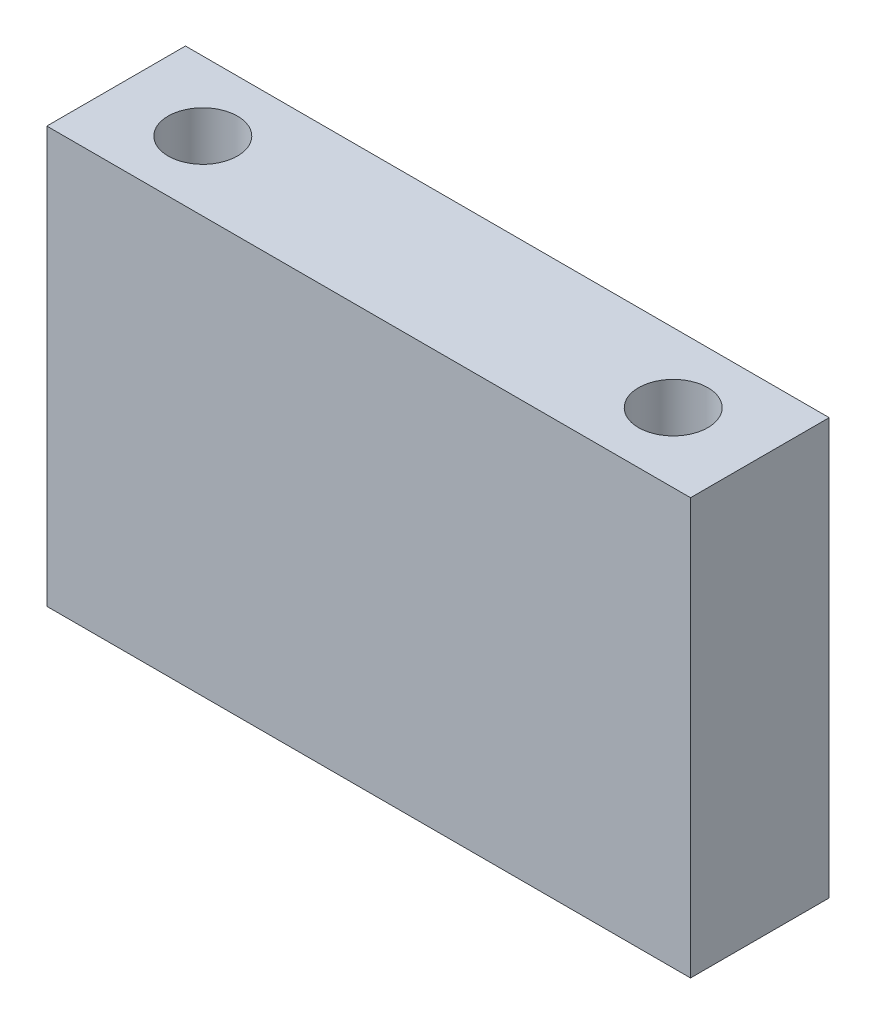
ISO-10303-21;
HEADER;
FILE_DESCRIPTION(('STEP AP214'),'2;1');
FILE_NAME('part.step','',(''),(''),'','','');
FILE_SCHEMA(('AUTOMOTIVE_DESIGN { 1 0 10303 214 1 1 1 1 }'));
ENDSEC;
DATA;
#1=APPLICATION_CONTEXT('core data for automotive mechanical design processes');
#2=APPLICATION_PROTOCOL_DEFINITION('international standard','automotive_design',2000,#1);
#3=PRODUCT_CONTEXT('',#1,'mechanical');
#4=PRODUCT('Part','Part','',(#3));
#5=PRODUCT_RELATED_PRODUCT_CATEGORY('part','',(#4));
#6=PRODUCT_DEFINITION_FORMATION('','',#4);
#7=PRODUCT_DEFINITION_CONTEXT('part definition',#1,'design');
#8=PRODUCT_DEFINITION('design','',#6,#7);
#9=PRODUCT_DEFINITION_SHAPE('','',#8);
#10=(LENGTH_UNIT() NAMED_UNIT(*) SI_UNIT(.MILLI.,.METRE.));
#11=(NAMED_UNIT(*) PLANE_ANGLE_UNIT() SI_UNIT($,.RADIAN.));
#12=(NAMED_UNIT(*) SI_UNIT($,.STERADIAN.) SOLID_ANGLE_UNIT());
#13=UNCERTAINTY_MEASURE_WITH_UNIT(LENGTH_MEASURE(1.E-05),#10,'distance_accuracy_value','');
#14=(GEOMETRIC_REPRESENTATION_CONTEXT(3) GLOBAL_UNCERTAINTY_ASSIGNED_CONTEXT((#13)) GLOBAL_UNIT_ASSIGNED_CONTEXT((#10,
#11,#12)) REPRESENTATION_CONTEXT('',''));
#15=CARTESIAN_POINT('',(0.,0.,0.));
#16=DIRECTION('',(0.,0.,1.));
#17=DIRECTION('',(1.,0.,0.));
#18=AXIS2_PLACEMENT_3D('',#15,#16,#17);
#19=CARTESIAN_POINT('',(0.,0.,14.));
#20=DIRECTION('',(1.,0.,0.));
#21=DIRECTION('',(0.,0.,-1.));
#22=AXIS2_PLACEMENT_3D('',#19,#20,#21);
#23=PLANE('',#22);
#24=DIRECTION('',(0.,-1.,0.));
#25=VECTOR('',#24,1.);
#26=CARTESIAN_POINT('',(0.,0.,0.));
#27=LINE('',#26,#25);
#28=CARTESIAN_POINT('',(0.,42.,0.));
#29=VERTEX_POINT('',#28);
#30=CARTESIAN_POINT('',(0.,0.,0.));
#31=VERTEX_POINT('',#30);
#32=EDGE_CURVE('E96',#29,#31,#27,.T.);
#33=ORIENTED_EDGE('',*,*,#32,.T.);
#34=DIRECTION('',(0.,0.,-1.));
#35=VECTOR('',#34,1.);
#36=CARTESIAN_POINT('',(0.,0.,14.));
#37=LINE('',#36,#35);
#38=CARTESIAN_POINT('',(0.,0.,14.));
#39=VERTEX_POINT('',#38);
#40=EDGE_CURVE('E11',#39,#31,#37,.T.);
#41=ORIENTED_EDGE('',*,*,#40,.F.);
#42=DIRECTION('',(0.,-1.,0.));
#43=VECTOR('',#42,1.);
#44=CARTESIAN_POINT('',(0.,0.,14.));
#45=LINE('',#44,#43);
#46=CARTESIAN_POINT('',(0.,42.,14.));
#47=VERTEX_POINT('',#46);
#48=EDGE_CURVE('E84',#47,#39,#45,.T.);
#49=ORIENTED_EDGE('',*,*,#48,.F.);
#50=DIRECTION('',(0.,0.,-1.));
#51=VECTOR('',#50,1.);
#52=CARTESIAN_POINT('',(0.,42.,14.));
#53=LINE('',#52,#51);
#54=EDGE_CURVE('E92',#47,#29,#53,.T.);
#55=ORIENTED_EDGE('',*,*,#54,.T.);
#56=EDGE_LOOP('',(#33,#41,#49,#55));
#57=FACE_BOUND('',#56,.T.);
#58=ADVANCED_FACE('F33',(#57),#23,.F.);
#59=CARTESIAN_POINT('',(0.,0.,14.));
#60=DIRECTION('',(0.,1.,0.));
#61=DIRECTION('',(0.,0.,1.));
#62=AXIS2_PLACEMENT_3D('',#59,#60,#61);
#63=PLANE('',#62);
#64=CARTESIAN_POINT('',(56.25,0.,6.99999999999999));
#65=DIRECTION('',(0.,1.,0.));
#66=DIRECTION('',(0.,0.,1.));
#67=AXIS2_PLACEMENT_3D('',#64,#65,#66);
#68=CIRCLE('',#67,3.5);
#69=CARTESIAN_POINT('',(56.25,0.,10.5));
#70=VERTEX_POINT('',#69);
#71=EDGE_CURVE('E113',#70,#70,#68,.T.);
#72=ORIENTED_EDGE('',*,*,#71,.T.);
#73=EDGE_LOOP('',(#72));
#74=FACE_BOUND('',#73,.T.);
#75=CARTESIAN_POINT('',(8.75,0.,7.));
#76=DIRECTION('',(0.,1.,0.));
#77=DIRECTION('',(0.,0.,1.));
#78=AXIS2_PLACEMENT_3D('',#75,#76,#77);
#79=CIRCLE('',#78,3.5);
#80=CARTESIAN_POINT('',(8.75,0.,10.5));
#81=VERTEX_POINT('',#80);
#82=EDGE_CURVE('E99',#81,#81,#79,.T.);
#83=ORIENTED_EDGE('',*,*,#82,.T.);
#84=EDGE_LOOP('',(#83));
#85=FACE_BOUND('',#84,.T.);
#86=DIRECTION('',(1.,0.,0.));
#87=VECTOR('',#86,1.);
#88=CARTESIAN_POINT('',(0.,0.,0.));
#89=LINE('',#88,#87);
#90=CARTESIAN_POINT('',(65.,0.,0.));
#91=VERTEX_POINT('',#90);
#92=EDGE_CURVE('E88',#31,#91,#89,.T.);
#93=ORIENTED_EDGE('',*,*,#92,.T.);
#94=DIRECTION('',(0.,0.,-1.));
#95=VECTOR('',#94,1.);
#96=CARTESIAN_POINT('',(65.,0.,14.));
#97=LINE('',#96,#95);
#98=CARTESIAN_POINT('',(65.,0.,14.));
#99=VERTEX_POINT('',#98);
#100=EDGE_CURVE('E41',#99,#91,#97,.T.);
#101=ORIENTED_EDGE('',*,*,#100,.F.);
#102=DIRECTION('',(1.,0.,0.));
#103=VECTOR('',#102,1.);
#104=CARTESIAN_POINT('',(0.,0.,14.));
#105=LINE('',#104,#103);
#106=EDGE_CURVE('E79',#39,#99,#105,.T.);
#107=ORIENTED_EDGE('',*,*,#106,.F.);
#108=ORIENTED_EDGE('',*,*,#40,.T.);
#109=EDGE_LOOP('',(#93,#101,#107,#108));
#110=FACE_BOUND('',#109,.T.);
#111=ADVANCED_FACE('F87',(#74,#85,#110),#63,.F.);
#112=CARTESIAN_POINT('',(65.,0.,14.));
#113=DIRECTION('',(-1.,0.,0.));
#114=DIRECTION('',(0.,0.,1.));
#115=AXIS2_PLACEMENT_3D('',#112,#113,#114);
#116=PLANE('',#115);
#117=DIRECTION('',(0.,1.,0.));
#118=VECTOR('',#117,1.);
#119=CARTESIAN_POINT('',(65.,0.,0.));
#120=LINE('',#119,#118);
#121=CARTESIAN_POINT('',(65.,42.,0.));
#122=VERTEX_POINT('',#121);
#123=EDGE_CURVE('E66',#91,#122,#120,.T.);
#124=ORIENTED_EDGE('',*,*,#123,.T.);
#125=DIRECTION('',(0.,0.,-1.));
#126=VECTOR('',#125,1.);
#127=CARTESIAN_POINT('',(65.,42.,14.));
#128=LINE('',#127,#126);
#129=CARTESIAN_POINT('',(65.,42.,14.));
#130=VERTEX_POINT('',#129);
#131=EDGE_CURVE('E89',#130,#122,#128,.T.);
#132=ORIENTED_EDGE('',*,*,#131,.F.);
#133=DIRECTION('',(0.,1.,0.));
#134=VECTOR('',#133,1.);
#135=CARTESIAN_POINT('',(65.,0.,14.));
#136=LINE('',#135,#134);
#137=EDGE_CURVE('E82',#99,#130,#136,.T.);
#138=ORIENTED_EDGE('',*,*,#137,.F.);
#139=ORIENTED_EDGE('',*,*,#100,.T.);
#140=EDGE_LOOP('',(#124,#132,#138,#139));
#141=FACE_BOUND('',#140,.T.);
#142=ADVANCED_FACE('F90',(#141),#116,.F.);
#143=CARTESIAN_POINT('',(0.,42.,14.));
#144=DIRECTION('',(0.,-1.,0.));
#145=DIRECTION('',(0.,0.,-1.));
#146=AXIS2_PLACEMENT_3D('',#143,#144,#145);
#147=PLANE('',#146);
#148=CARTESIAN_POINT('',(56.25,42.,6.99999999999999));
#149=DIRECTION('',(0.,1.,0.));
#150=DIRECTION('',(0.,0.,1.));
#151=AXIS2_PLACEMENT_3D('',#148,#149,#150);
#152=CIRCLE('',#151,3.5);
#153=CARTESIAN_POINT('',(56.25,42.,10.5));
#154=VERTEX_POINT('',#153);
#155=EDGE_CURVE('E116',#154,#154,#152,.T.);
#156=ORIENTED_EDGE('',*,*,#155,.F.);
#157=EDGE_LOOP('',(#156));
#158=FACE_BOUND('',#157,.T.);
#159=CARTESIAN_POINT('',(8.75,42.,7.));
#160=DIRECTION('',(0.,1.,0.));
#161=DIRECTION('',(0.,0.,1.));
#162=AXIS2_PLACEMENT_3D('',#159,#160,#161);
#163=CIRCLE('',#162,3.5);
#164=CARTESIAN_POINT('',(8.75,42.,10.5));
#165=VERTEX_POINT('',#164);
#166=EDGE_CURVE('E110',#165,#165,#163,.T.);
#167=ORIENTED_EDGE('',*,*,#166,.F.);
#168=EDGE_LOOP('',(#167));
#169=FACE_BOUND('',#168,.T.);
#170=DIRECTION('',(-1.,0.,0.));
#171=VECTOR('',#170,1.);
#172=CARTESIAN_POINT('',(0.,42.,0.));
#173=LINE('',#172,#171);
#174=EDGE_CURVE('E72',#122,#29,#173,.T.);
#175=ORIENTED_EDGE('',*,*,#174,.T.);
#176=ORIENTED_EDGE('',*,*,#54,.F.);
#177=DIRECTION('',(-1.,0.,0.));
#178=VECTOR('',#177,1.);
#179=CARTESIAN_POINT('',(0.,42.,14.));
#180=LINE('',#179,#178);
#181=EDGE_CURVE('E49',#130,#47,#180,.T.);
#182=ORIENTED_EDGE('',*,*,#181,.F.);
#183=ORIENTED_EDGE('',*,*,#131,.T.);
#184=EDGE_LOOP('',(#175,#176,#182,#183));
#185=FACE_BOUND('',#184,.T.);
#186=ADVANCED_FACE('F104',(#158,#169,#185),#147,.F.);
#187=CARTESIAN_POINT('',(0.,0.,14.));
#188=DIRECTION('',(0.,0.,-1.));
#189=DIRECTION('',(-1.,0.,0.));
#190=AXIS2_PLACEMENT_3D('',#187,#188,#189);
#191=PLANE('',#190);
#192=ORIENTED_EDGE('',*,*,#48,.T.);
#193=ORIENTED_EDGE('',*,*,#106,.T.);
#194=ORIENTED_EDGE('',*,*,#137,.T.);
#195=ORIENTED_EDGE('',*,*,#181,.T.);
#196=EDGE_LOOP('',(#192,#193,#194,#195));
#197=FACE_BOUND('',#196,.T.);
#198=ADVANCED_FACE('F80',(#197),#191,.F.);
#199=CARTESIAN_POINT('',(0.,0.,0.));
#200=DIRECTION('',(0.,0.,-1.));
#201=DIRECTION('',(-1.,0.,0.));
#202=AXIS2_PLACEMENT_3D('',#199,#200,#201);
#203=PLANE('',#202);
#204=ORIENTED_EDGE('',*,*,#32,.F.);
#205=ORIENTED_EDGE('',*,*,#174,.F.);
#206=ORIENTED_EDGE('',*,*,#123,.F.);
#207=ORIENTED_EDGE('',*,*,#92,.F.);
#208=EDGE_LOOP('',(#204,#205,#206,#207));
#209=FACE_BOUND('',#208,.T.);
#210=ADVANCED_FACE('F107',(#209),#203,.T.);
#211=CARTESIAN_POINT('',(8.75,0.,7.));
#212=DIRECTION('',(0.,1.,0.));
#213=DIRECTION('',(0.,0.,1.));
#214=AXIS2_PLACEMENT_3D('',#211,#212,#213);
#215=CYLINDRICAL_SURFACE('',#214,3.5);
#216=ORIENTED_EDGE('',*,*,#82,.F.);
#217=EDGE_LOOP('',(#216));
#218=FACE_BOUND('',#217,.T.);
#219=ORIENTED_EDGE('',*,*,#166,.T.);
#220=EDGE_LOOP('',(#219));
#221=FACE_BOUND('',#220,.T.);
#222=ADVANCED_FACE('F127',(#218,#221),#215,.F.);
#223=CARTESIAN_POINT('',(56.25,0.,6.99999999999999));
#224=DIRECTION('',(0.,1.,0.));
#225=DIRECTION('',(0.,0.,1.));
#226=AXIS2_PLACEMENT_3D('',#223,#224,#225);
#227=CYLINDRICAL_SURFACE('',#226,3.5);
#228=ORIENTED_EDGE('',*,*,#71,.F.);
#229=EDGE_LOOP('',(#228));
#230=FACE_BOUND('',#229,.T.);
#231=ORIENTED_EDGE('',*,*,#155,.T.);
#232=EDGE_LOOP('',(#231));
#233=FACE_BOUND('',#232,.T.);
#234=ADVANCED_FACE('F124',(#230,#233),#227,.F.);
#235=CLOSED_SHELL('',(#58,#111,#142,#186,#198,#210,#222,#234));
#236=MANIFOLD_SOLID_BREP('B2',#235);
#237=ADVANCED_BREP_SHAPE_REPRESENTATION('',(#18,#236),#14);
#238=SHAPE_DEFINITION_REPRESENTATION(#9,#237);
ENDSEC;
END-ISO-10303-21;
